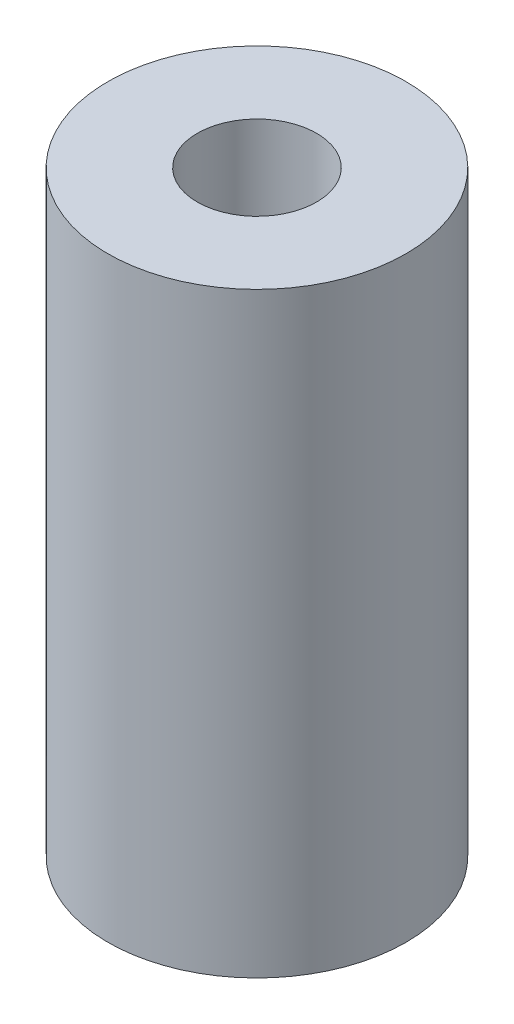
ISO-10303-21;
HEADER;
FILE_DESCRIPTION(('STEP AP214'),'2;1');
FILE_NAME('part.step','',(''),(''),'','','');
FILE_SCHEMA(('AUTOMOTIVE_DESIGN { 1 0 10303 214 1 1 1 1 }'));
ENDSEC;
DATA;
#1=APPLICATION_CONTEXT('core data for automotive mechanical design processes');
#2=APPLICATION_PROTOCOL_DEFINITION('international standard','automotive_design',2000,#1);
#3=PRODUCT_CONTEXT('',#1,'mechanical');
#4=PRODUCT('Part','Part','',(#3));
#5=PRODUCT_RELATED_PRODUCT_CATEGORY('part','',(#4));
#6=PRODUCT_DEFINITION_FORMATION('','',#4);
#7=PRODUCT_DEFINITION_CONTEXT('part definition',#1,'design');
#8=PRODUCT_DEFINITION('design','',#6,#7);
#9=PRODUCT_DEFINITION_SHAPE('','',#8);
#10=(LENGTH_UNIT() NAMED_UNIT(*) SI_UNIT(.MILLI.,.METRE.));
#11=(NAMED_UNIT(*) PLANE_ANGLE_UNIT() SI_UNIT($,.RADIAN.));
#12=(NAMED_UNIT(*) SI_UNIT($,.STERADIAN.) SOLID_ANGLE_UNIT());
#13=UNCERTAINTY_MEASURE_WITH_UNIT(LENGTH_MEASURE(1.E-05),#10,'distance_accuracy_value','');
#14=(GEOMETRIC_REPRESENTATION_CONTEXT(3) GLOBAL_UNCERTAINTY_ASSIGNED_CONTEXT((#13)) GLOBAL_UNIT_ASSIGNED_CONTEXT((#10,
#11,#12)) REPRESENTATION_CONTEXT('',''));
#15=CARTESIAN_POINT('',(0.,0.,0.));
#16=DIRECTION('',(0.,0.,1.));
#17=DIRECTION('',(1.,0.,0.));
#18=AXIS2_PLACEMENT_3D('',#15,#16,#17);
#19=CARTESIAN_POINT('',(0.,10.,0.));
#20=DIRECTION('',(0.,1.,0.));
#21=DIRECTION('',(0.,0.,1.));
#22=AXIS2_PLACEMENT_3D('',#19,#20,#21);
#23=PLANE('',#22);
#24=CARTESIAN_POINT('',(0.,10.,0.));
#25=DIRECTION('',(0.,1.,0.));
#26=DIRECTION('',(1.,0.,0.));
#27=AXIS2_PLACEMENT_3D('',#24,#25,#26);
#28=CIRCLE('',#27,2.5);
#29=CARTESIAN_POINT('',(2.5,10.,0.));
#30=VERTEX_POINT('',#29);
#31=EDGE_CURVE('E11',#30,#30,#28,.T.);
#32=ORIENTED_EDGE('',*,*,#31,.T.);
#33=EDGE_LOOP('',(#32));
#34=FACE_BOUND('',#33,.T.);
#35=CARTESIAN_POINT('',(0.,10.,0.));
#36=DIRECTION('',(0.,1.,0.));
#37=DIRECTION('',(0.,0.,1.));
#38=AXIS2_PLACEMENT_3D('',#35,#36,#37);
#39=CIRCLE('',#38,1.);
#40=CARTESIAN_POINT('',(0.,10.,1.));
#41=VERTEX_POINT('',#40);
#42=EDGE_CURVE('E48',#41,#41,#39,.T.);
#43=ORIENTED_EDGE('',*,*,#42,.F.);
#44=EDGE_LOOP('',(#43));
#45=FACE_BOUND('',#44,.T.);
#46=ADVANCED_FACE('F37',(#34,#45),#23,.T.);
#47=CARTESIAN_POINT('',(0.,0.,0.));
#48=DIRECTION('',(0.,1.,0.));
#49=DIRECTION('',(0.,0.,1.));
#50=AXIS2_PLACEMENT_3D('',#47,#48,#49);
#51=PLANE('',#50);
#52=CARTESIAN_POINT('',(0.,0.,0.));
#53=DIRECTION('',(0.,1.,0.));
#54=DIRECTION('',(1.,0.,0.));
#55=AXIS2_PLACEMENT_3D('',#52,#53,#54);
#56=CIRCLE('',#55,2.5);
#57=CARTESIAN_POINT('',(2.5,0.,0.));
#58=VERTEX_POINT('',#57);
#59=EDGE_CURVE('E41',#58,#58,#56,.T.);
#60=ORIENTED_EDGE('',*,*,#59,.F.);
#61=EDGE_LOOP('',(#60));
#62=FACE_BOUND('',#61,.T.);
#63=CARTESIAN_POINT('',(0.,0.,0.));
#64=DIRECTION('',(0.,1.,0.));
#65=DIRECTION('',(0.,0.,1.));
#66=AXIS2_PLACEMENT_3D('',#63,#64,#65);
#67=CIRCLE('',#66,1.);
#68=CARTESIAN_POINT('',(0.,0.,1.));
#69=VERTEX_POINT('',#68);
#70=EDGE_CURVE('E50',#69,#69,#67,.T.);
#71=ORIENTED_EDGE('',*,*,#70,.T.);
#72=EDGE_LOOP('',(#71));
#73=FACE_BOUND('',#72,.T.);
#74=ADVANCED_FACE('F60',(#62,#73),#51,.F.);
#75=CARTESIAN_POINT('',(0.,10.,0.));
#76=DIRECTION('',(0.,-1.,0.));
#77=DIRECTION('',(0.,0.,-1.));
#78=AXIS2_PLACEMENT_3D('',#75,#76,#77);
#79=CYLINDRICAL_SURFACE('',#78,2.5);
#80=ORIENTED_EDGE('',*,*,#31,.F.);
#81=EDGE_LOOP('',(#80));
#82=FACE_BOUND('',#81,.T.);
#83=ORIENTED_EDGE('',*,*,#59,.T.);
#84=EDGE_LOOP('',(#83));
#85=FACE_BOUND('',#84,.T.);
#86=ADVANCED_FACE('F39',(#82,#85),#79,.T.);
#87=CARTESIAN_POINT('',(0.,10.,0.));
#88=DIRECTION('',(0.,-1.,0.));
#89=DIRECTION('',(0.,0.,-1.));
#90=AXIS2_PLACEMENT_3D('',#87,#88,#89);
#91=CYLINDRICAL_SURFACE('',#90,1.);
#92=ORIENTED_EDGE('',*,*,#42,.T.);
#93=EDGE_LOOP('',(#92));
#94=FACE_BOUND('',#93,.T.);
#95=ORIENTED_EDGE('',*,*,#70,.F.);
#96=EDGE_LOOP('',(#95));
#97=FACE_BOUND('',#96,.T.);
#98=ADVANCED_FACE('F56',(#94,#97),#91,.F.);
#99=CLOSED_SHELL('',(#46,#74,#86,#98));
#100=MANIFOLD_SOLID_BREP('B2',#99);
#101=ADVANCED_BREP_SHAPE_REPRESENTATION('',(#18,#100),#14);
#102=SHAPE_DEFINITION_REPRESENTATION(#9,#101);
ENDSEC;
END-ISO-10303-21;
